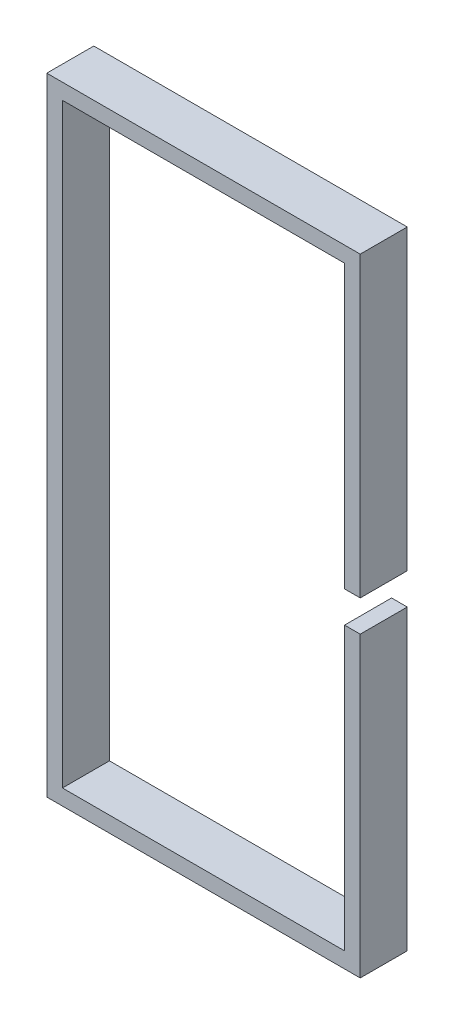
ISO-10303-21;
HEADER;
FILE_DESCRIPTION(('STEP AP214'),'2;1');
FILE_NAME('part.step','',(''),(''),'','','');
FILE_SCHEMA(('AUTOMOTIVE_DESIGN { 1 0 10303 214 1 1 1 1 }'));
ENDSEC;
DATA;
#1=APPLICATION_CONTEXT('core data for automotive mechanical design processes');
#2=APPLICATION_PROTOCOL_DEFINITION('international standard','automotive_design',2000,#1);
#3=PRODUCT_CONTEXT('',#1,'mechanical');
#4=PRODUCT('Part','Part','',(#3));
#5=PRODUCT_RELATED_PRODUCT_CATEGORY('part','',(#4));
#6=PRODUCT_DEFINITION_FORMATION('','',#4);
#7=PRODUCT_DEFINITION_CONTEXT('part definition',#1,'design');
#8=PRODUCT_DEFINITION('design','',#6,#7);
#9=PRODUCT_DEFINITION_SHAPE('','',#8);
#10=(LENGTH_UNIT() NAMED_UNIT(*) SI_UNIT(.MILLI.,.METRE.));
#11=(NAMED_UNIT(*) PLANE_ANGLE_UNIT() SI_UNIT($,.RADIAN.));
#12=(NAMED_UNIT(*) SI_UNIT($,.STERADIAN.) SOLID_ANGLE_UNIT());
#13=UNCERTAINTY_MEASURE_WITH_UNIT(LENGTH_MEASURE(1.E-05),#10,'distance_accuracy_value','');
#14=(GEOMETRIC_REPRESENTATION_CONTEXT(3) GLOBAL_UNCERTAINTY_ASSIGNED_CONTEXT((#13)) GLOBAL_UNIT_ASSIGNED_CONTEXT((#10,
#11,#12)) REPRESENTATION_CONTEXT('',''));
#15=CARTESIAN_POINT('',(0.,0.,0.));
#16=DIRECTION('',(0.,0.,1.));
#17=DIRECTION('',(1.,0.,0.));
#18=AXIS2_PLACEMENT_3D('',#15,#16,#17);
#19=CARTESIAN_POINT('',(-10.,0.,30.));
#20=DIRECTION('',(1.,0.,0.));
#21=DIRECTION('',(0.,0.,-1.));
#22=AXIS2_PLACEMENT_3D('',#19,#20,#21);
#23=PLANE('',#22);
#24=DIRECTION('',(0.,1.,0.));
#25=VECTOR('',#24,1.);
#26=CARTESIAN_POINT('',(-10.,0.,0.));
#27=LINE('',#26,#25);
#28=CARTESIAN_POINT('',(-10.,-10.,0.));
#29=VERTEX_POINT('',#28);
#30=CARTESIAN_POINT('',(-10.,-190.,0.));
#31=VERTEX_POINT('',#30);
#32=EDGE_CURVE('E164',#29,#31,#27,.F.);
#33=ORIENTED_EDGE('',*,*,#32,.T.);
#34=DIRECTION('',(0.,0.,-1.));
#35=VECTOR('',#34,1.);
#36=CARTESIAN_POINT('',(-10.,-190.,30.));
#37=LINE('',#36,#35);
#38=CARTESIAN_POINT('',(-10.,-190.,30.));
#39=VERTEX_POINT('',#38);
#40=EDGE_CURVE('E11',#39,#31,#37,.T.);
#41=ORIENTED_EDGE('',*,*,#40,.F.);
#42=DIRECTION('',(0.,1.,0.));
#43=VECTOR('',#42,1.);
#44=CARTESIAN_POINT('',(-10.,0.,30.));
#45=LINE('',#44,#43);
#46=CARTESIAN_POINT('',(-10.,-10.,30.));
#47=VERTEX_POINT('',#46);
#48=EDGE_CURVE('E108',#47,#39,#45,.F.);
#49=ORIENTED_EDGE('',*,*,#48,.F.);
#50=DIRECTION('',(0.,0.,-1.));
#51=VECTOR('',#50,1.);
#52=CARTESIAN_POINT('',(-10.,-10.,30.));
#53=LINE('',#52,#51);
#54=EDGE_CURVE('E160',#47,#29,#53,.T.);
#55=ORIENTED_EDGE('',*,*,#54,.T.);
#56=EDGE_LOOP('',(#33,#41,#49,#55));
#57=FACE_BOUND('',#56,.T.);
#58=ADVANCED_FACE('F39',(#57),#23,.F.);
#59=CARTESIAN_POINT('',(0.,-190.,30.));
#60=DIRECTION('',(0.,-1.,0.));
#61=DIRECTION('',(0.,0.,-1.));
#62=AXIS2_PLACEMENT_3D('',#59,#60,#61);
#63=PLANE('',#62);
#64=DIRECTION('',(-1.,0.,0.));
#65=VECTOR('',#64,1.);
#66=CARTESIAN_POINT('',(0.,-190.,0.));
#67=LINE('',#66,#65);
#68=CARTESIAN_POINT('',(0.,-190.,0.));
#69=VERTEX_POINT('',#68);
#70=EDGE_CURVE('E168',#69,#31,#67,.T.);
#71=ORIENTED_EDGE('',*,*,#70,.F.);
#72=DIRECTION('',(0.,0.,-1.));
#73=VECTOR('',#72,1.);
#74=CARTESIAN_POINT('',(0.,-190.,30.));
#75=LINE('',#74,#73);
#76=CARTESIAN_POINT('',(0.,-190.,30.));
#77=VERTEX_POINT('',#76);
#78=EDGE_CURVE('E48',#77,#69,#75,.T.);
#79=ORIENTED_EDGE('',*,*,#78,.F.);
#80=DIRECTION('',(-1.,0.,0.));
#81=VECTOR('',#80,1.);
#82=CARTESIAN_POINT('',(0.,-190.,30.));
#83=LINE('',#82,#81);
#84=EDGE_CURVE('E251',#77,#39,#83,.T.);
#85=ORIENTED_EDGE('',*,*,#84,.T.);
#86=ORIENTED_EDGE('',*,*,#40,.T.);
#87=EDGE_LOOP('',(#71,#79,#85,#86));
#88=FACE_BOUND('',#87,.T.);
#89=ADVANCED_FACE('F238',(#88),#63,.T.);
#90=CARTESIAN_POINT('',(0.,0.,30.));
#91=DIRECTION('',(1.,0.,0.));
#92=DIRECTION('',(0.,0.,-1.));
#93=AXIS2_PLACEMENT_3D('',#90,#91,#92);
#94=PLANE('',#93);
#95=DIRECTION('',(0.,-1.,0.));
#96=VECTOR('',#95,1.);
#97=CARTESIAN_POINT('',(0.,0.,0.));
#98=LINE('',#97,#96);
#99=CARTESIAN_POINT('',(0.,0.,0.));
#100=VERTEX_POINT('',#99);
#101=EDGE_CURVE('E172',#100,#69,#98,.T.);
#102=ORIENTED_EDGE('',*,*,#101,.F.);
#103=DIRECTION('',(0.,0.,-1.));
#104=VECTOR('',#103,1.);
#105=CARTESIAN_POINT('',(0.,0.,30.));
#106=LINE('',#105,#104);
#107=CARTESIAN_POINT('',(0.,0.,30.));
#108=VERTEX_POINT('',#107);
#109=EDGE_CURVE('E226',#108,#100,#106,.T.);
#110=ORIENTED_EDGE('',*,*,#109,.F.);
#111=DIRECTION('',(0.,-1.,0.));
#112=VECTOR('',#111,1.);
#113=CARTESIAN_POINT('',(0.,0.,30.));
#114=LINE('',#113,#112);
#115=EDGE_CURVE('E235',#108,#77,#114,.T.);
#116=ORIENTED_EDGE('',*,*,#115,.T.);
#117=ORIENTED_EDGE('',*,*,#78,.T.);
#118=EDGE_LOOP('',(#102,#110,#116,#117));
#119=FACE_BOUND('',#118,.T.);
#120=ADVANCED_FACE('F233',(#119),#94,.T.);
#121=CARTESIAN_POINT('',(0.,0.,30.));
#122=DIRECTION('',(0.,1.,0.));
#123=DIRECTION('',(0.,0.,1.));
#124=AXIS2_PLACEMENT_3D('',#121,#122,#123);
#125=PLANE('',#124);
#126=DIRECTION('',(1.,0.,0.));
#127=VECTOR('',#126,1.);
#128=CARTESIAN_POINT('',(0.,0.,0.));
#129=LINE('',#128,#127);
#130=CARTESIAN_POINT('',(-200.,0.,0.));
#131=VERTEX_POINT('',#130);
#132=EDGE_CURVE('E176',#131,#100,#129,.T.);
#133=ORIENTED_EDGE('',*,*,#132,.F.);
#134=DIRECTION('',(0.,0.,-1.));
#135=VECTOR('',#134,1.);
#136=CARTESIAN_POINT('',(-200.,0.,30.));
#137=LINE('',#136,#135);
#138=CARTESIAN_POINT('',(-200.,0.,30.));
#139=VERTEX_POINT('',#138);
#140=EDGE_CURVE('E223',#139,#131,#137,.T.);
#141=ORIENTED_EDGE('',*,*,#140,.F.);
#142=DIRECTION('',(1.,0.,0.));
#143=VECTOR('',#142,1.);
#144=CARTESIAN_POINT('',(0.,0.,30.));
#145=LINE('',#144,#143);
#146=EDGE_CURVE('E248',#139,#108,#145,.T.);
#147=ORIENTED_EDGE('',*,*,#146,.T.);
#148=ORIENTED_EDGE('',*,*,#109,.T.);
#149=EDGE_LOOP('',(#133,#141,#147,#148));
#150=FACE_BOUND('',#149,.T.);
#151=ADVANCED_FACE('F245',(#150),#125,.T.);
#152=CARTESIAN_POINT('',(-200.,0.,30.));
#153=DIRECTION('',(-1.,0.,0.));
#154=DIRECTION('',(0.,0.,1.));
#155=AXIS2_PLACEMENT_3D('',#152,#153,#154);
#156=PLANE('',#155);
#157=DIRECTION('',(0.,1.,0.));
#158=VECTOR('',#157,1.);
#159=CARTESIAN_POINT('',(-200.,0.,0.));
#160=LINE('',#159,#158);
#161=CARTESIAN_POINT('',(-200.,-400.,0.));
#162=VERTEX_POINT('',#161);
#163=EDGE_CURVE('E180',#162,#131,#160,.T.);
#164=ORIENTED_EDGE('',*,*,#163,.F.);
#165=DIRECTION('',(0.,0.,-1.));
#166=VECTOR('',#165,1.);
#167=CARTESIAN_POINT('',(-200.,-400.,30.));
#168=LINE('',#167,#166);
#169=CARTESIAN_POINT('',(-200.,-400.,30.));
#170=VERTEX_POINT('',#169);
#171=EDGE_CURVE('E220',#170,#162,#168,.T.);
#172=ORIENTED_EDGE('',*,*,#171,.F.);
#173=DIRECTION('',(0.,1.,0.));
#174=VECTOR('',#173,1.);
#175=CARTESIAN_POINT('',(-200.,0.,30.));
#176=LINE('',#175,#174);
#177=EDGE_CURVE('E256',#170,#139,#176,.T.);
#178=ORIENTED_EDGE('',*,*,#177,.T.);
#179=ORIENTED_EDGE('',*,*,#140,.T.);
#180=EDGE_LOOP('',(#164,#172,#178,#179));
#181=FACE_BOUND('',#180,.T.);
#182=ADVANCED_FACE('F361',(#181),#156,.T.);
#183=CARTESIAN_POINT('',(-200.,-400.,30.));
#184=DIRECTION('',(0.,-1.,0.));
#185=DIRECTION('',(0.,0.,-1.));
#186=AXIS2_PLACEMENT_3D('',#183,#184,#185);
#187=PLANE('',#186);
#188=DIRECTION('',(-1.,0.,0.));
#189=VECTOR('',#188,1.);
#190=CARTESIAN_POINT('',(-200.,-400.,0.));
#191=LINE('',#190,#189);
#192=CARTESIAN_POINT('',(0.,-400.,0.));
#193=VERTEX_POINT('',#192);
#194=EDGE_CURVE('E184',#193,#162,#191,.T.);
#195=ORIENTED_EDGE('',*,*,#194,.F.);
#196=DIRECTION('',(0.,0.,-1.));
#197=VECTOR('',#196,1.);
#198=CARTESIAN_POINT('',(0.,-400.,30.));
#199=LINE('',#198,#197);
#200=CARTESIAN_POINT('',(0.,-400.,30.));
#201=VERTEX_POINT('',#200);
#202=EDGE_CURVE('E217',#201,#193,#199,.T.);
#203=ORIENTED_EDGE('',*,*,#202,.F.);
#204=DIRECTION('',(-1.,0.,0.));
#205=VECTOR('',#204,1.);
#206=CARTESIAN_POINT('',(-200.,-400.,30.));
#207=LINE('',#206,#205);
#208=EDGE_CURVE('E263',#201,#170,#207,.T.);
#209=ORIENTED_EDGE('',*,*,#208,.T.);
#210=ORIENTED_EDGE('',*,*,#171,.T.);
#211=EDGE_LOOP('',(#195,#203,#209,#210));
#212=FACE_BOUND('',#211,.T.);
#213=ADVANCED_FACE('F352',(#212),#187,.T.);
#214=CARTESIAN_POINT('',(0.,-400.,30.));
#215=DIRECTION('',(1.,0.,0.));
#216=DIRECTION('',(0.,0.,-1.));
#217=AXIS2_PLACEMENT_3D('',#214,#215,#216);
#218=PLANE('',#217);
#219=DIRECTION('',(0.,-1.,0.));
#220=VECTOR('',#219,1.);
#221=CARTESIAN_POINT('',(0.,-400.,0.));
#222=LINE('',#221,#220);
#223=CARTESIAN_POINT('',(0.,-210.,0.));
#224=VERTEX_POINT('',#223);
#225=EDGE_CURVE('E188',#224,#193,#222,.T.);
#226=ORIENTED_EDGE('',*,*,#225,.F.);
#227=DIRECTION('',(0.,0.,-1.));
#228=VECTOR('',#227,1.);
#229=CARTESIAN_POINT('',(0.,-210.,30.));
#230=LINE('',#229,#228);
#231=CARTESIAN_POINT('',(0.,-210.,30.));
#232=VERTEX_POINT('',#231);
#233=EDGE_CURVE('E214',#232,#224,#230,.T.);
#234=ORIENTED_EDGE('',*,*,#233,.F.);
#235=DIRECTION('',(0.,-1.,0.));
#236=VECTOR('',#235,1.);
#237=CARTESIAN_POINT('',(0.,-400.,30.));
#238=LINE('',#237,#236);
#239=EDGE_CURVE('E267',#232,#201,#238,.T.);
#240=ORIENTED_EDGE('',*,*,#239,.T.);
#241=ORIENTED_EDGE('',*,*,#202,.T.);
#242=EDGE_LOOP('',(#226,#234,#240,#241));
#243=FACE_BOUND('',#242,.T.);
#244=ADVANCED_FACE('F282',(#243),#218,.T.);
#245=CARTESIAN_POINT('',(-10.,-210.,30.));
#246=DIRECTION('',(0.,1.,0.));
#247=DIRECTION('',(0.,0.,1.));
#248=AXIS2_PLACEMENT_3D('',#245,#246,#247);
#249=PLANE('',#248);
#250=DIRECTION('',(1.,0.,0.));
#251=VECTOR('',#250,1.);
#252=CARTESIAN_POINT('',(-10.,-210.,0.));
#253=LINE('',#252,#251);
#254=CARTESIAN_POINT('',(-10.,-210.,0.));
#255=VERTEX_POINT('',#254);
#256=EDGE_CURVE('E192',#255,#224,#253,.T.);
#257=ORIENTED_EDGE('',*,*,#256,.F.);
#258=DIRECTION('',(0.,0.,-1.));
#259=VECTOR('',#258,1.);
#260=CARTESIAN_POINT('',(-10.,-210.,30.));
#261=LINE('',#260,#259);
#262=CARTESIAN_POINT('',(-10.,-210.,30.));
#263=VERTEX_POINT('',#262);
#264=EDGE_CURVE('E211',#263,#255,#261,.T.);
#265=ORIENTED_EDGE('',*,*,#264,.F.);
#266=DIRECTION('',(1.,0.,0.));
#267=VECTOR('',#266,1.);
#268=CARTESIAN_POINT('',(-10.,-210.,30.));
#269=LINE('',#268,#267);
#270=EDGE_CURVE('E271',#263,#232,#269,.T.);
#271=ORIENTED_EDGE('',*,*,#270,.T.);
#272=ORIENTED_EDGE('',*,*,#233,.T.);
#273=EDGE_LOOP('',(#257,#265,#271,#272));
#274=FACE_BOUND('',#273,.T.);
#275=ADVANCED_FACE('F277',(#274),#249,.T.);
#276=CARTESIAN_POINT('',(-10.,-400.,30.));
#277=DIRECTION('',(1.,0.,0.));
#278=DIRECTION('',(0.,0.,-1.));
#279=AXIS2_PLACEMENT_3D('',#276,#277,#278);
#280=PLANE('',#279);
#281=DIRECTION('',(0.,1.,0.));
#282=VECTOR('',#281,1.);
#283=CARTESIAN_POINT('',(-10.,-400.,0.));
#284=LINE('',#283,#282);
#285=CARTESIAN_POINT('',(-10.,-390.,0.));
#286=VERTEX_POINT('',#285);
#287=EDGE_CURVE('E196',#255,#286,#284,.F.);
#288=ORIENTED_EDGE('',*,*,#287,.T.);
#289=DIRECTION('',(0.,0.,-1.));
#290=VECTOR('',#289,1.);
#291=CARTESIAN_POINT('',(-10.,-390.,30.));
#292=LINE('',#291,#290);
#293=CARTESIAN_POINT('',(-10.,-390.,30.));
#294=VERTEX_POINT('',#293);
#295=EDGE_CURVE('E153',#294,#286,#292,.T.);
#296=ORIENTED_EDGE('',*,*,#295,.F.);
#297=DIRECTION('',(0.,1.,0.));
#298=VECTOR('',#297,1.);
#299=CARTESIAN_POINT('',(-10.,-400.,30.));
#300=LINE('',#299,#298);
#301=EDGE_CURVE('E142',#263,#294,#300,.F.);
#302=ORIENTED_EDGE('',*,*,#301,.F.);
#303=ORIENTED_EDGE('',*,*,#264,.T.);
#304=EDGE_LOOP('',(#288,#296,#302,#303));
#305=FACE_BOUND('',#304,.T.);
#306=ADVANCED_FACE('F286',(#305),#280,.F.);
#307=CARTESIAN_POINT('',(-200.,-390.,30.));
#308=DIRECTION('',(0.,-1.,0.));
#309=DIRECTION('',(0.,0.,-1.));
#310=AXIS2_PLACEMENT_3D('',#307,#308,#309);
#311=PLANE('',#310);
#312=DIRECTION('',(1.,0.,0.));
#313=VECTOR('',#312,1.);
#314=CARTESIAN_POINT('',(-200.,-390.,0.));
#315=LINE('',#314,#313);
#316=CARTESIAN_POINT('',(-190.,-390.,0.));
#317=VERTEX_POINT('',#316);
#318=EDGE_CURVE('E151',#286,#317,#315,.F.);
#319=ORIENTED_EDGE('',*,*,#318,.T.);
#320=DIRECTION('',(0.,0.,-1.));
#321=VECTOR('',#320,1.);
#322=CARTESIAN_POINT('',(-190.,-390.,30.));
#323=LINE('',#322,#321);
#324=CARTESIAN_POINT('',(-190.,-390.,30.));
#325=VERTEX_POINT('',#324);
#326=EDGE_CURVE('E148',#325,#317,#323,.T.);
#327=ORIENTED_EDGE('',*,*,#326,.F.);
#328=DIRECTION('',(1.,0.,0.));
#329=VECTOR('',#328,1.);
#330=CARTESIAN_POINT('',(-200.,-390.,30.));
#331=LINE('',#330,#329);
#332=EDGE_CURVE('E135',#294,#325,#331,.F.);
#333=ORIENTED_EDGE('',*,*,#332,.F.);
#334=ORIENTED_EDGE('',*,*,#295,.T.);
#335=EDGE_LOOP('',(#319,#327,#333,#334));
#336=FACE_BOUND('',#335,.T.);
#337=ADVANCED_FACE('F149',(#336),#311,.F.);
#338=CARTESIAN_POINT('',(-190.,0.,30.));
#339=DIRECTION('',(-1.,0.,0.));
#340=DIRECTION('',(0.,0.,1.));
#341=AXIS2_PLACEMENT_3D('',#338,#339,#340);
#342=PLANE('',#341);
#343=DIRECTION('',(0.,1.,0.));
#344=VECTOR('',#343,1.);
#345=CARTESIAN_POINT('',(-190.,0.,0.));
#346=LINE('',#345,#344);
#347=CARTESIAN_POINT('',(-190.,-10.,0.));
#348=VERTEX_POINT('',#347);
#349=EDGE_CURVE('E96',#317,#348,#346,.T.);
#350=ORIENTED_EDGE('',*,*,#349,.T.);
#351=DIRECTION('',(0.,0.,-1.));
#352=VECTOR('',#351,1.);
#353=CARTESIAN_POINT('',(-190.,-10.,30.));
#354=LINE('',#353,#352);
#355=CARTESIAN_POINT('',(-190.,-10.,30.));
#356=VERTEX_POINT('',#355);
#357=EDGE_CURVE('E154',#356,#348,#354,.T.);
#358=ORIENTED_EDGE('',*,*,#357,.F.);
#359=DIRECTION('',(0.,1.,0.));
#360=VECTOR('',#359,1.);
#361=CARTESIAN_POINT('',(-190.,0.,30.));
#362=LINE('',#361,#360);
#363=EDGE_CURVE('E139',#325,#356,#362,.T.);
#364=ORIENTED_EDGE('',*,*,#363,.F.);
#365=ORIENTED_EDGE('',*,*,#326,.T.);
#366=EDGE_LOOP('',(#350,#358,#364,#365));
#367=FACE_BOUND('',#366,.T.);
#368=ADVANCED_FACE('F156',(#367),#342,.F.);
#369=CARTESIAN_POINT('',(0.,-10.,30.));
#370=DIRECTION('',(0.,1.,0.));
#371=DIRECTION('',(0.,0.,1.));
#372=AXIS2_PLACEMENT_3D('',#369,#370,#371);
#373=PLANE('',#372);
#374=DIRECTION('',(1.,0.,0.));
#375=VECTOR('',#374,1.);
#376=CARTESIAN_POINT('',(0.,-10.,0.));
#377=LINE('',#376,#375);
#378=EDGE_CURVE('E102',#348,#29,#377,.T.);
#379=ORIENTED_EDGE('',*,*,#378,.T.);
#380=ORIENTED_EDGE('',*,*,#54,.F.);
#381=DIRECTION('',(1.,0.,0.));
#382=VECTOR('',#381,1.);
#383=CARTESIAN_POINT('',(0.,-10.,30.));
#384=LINE('',#383,#382);
#385=EDGE_CURVE('E56',#356,#47,#384,.T.);
#386=ORIENTED_EDGE('',*,*,#385,.F.);
#387=ORIENTED_EDGE('',*,*,#357,.T.);
#388=EDGE_LOOP('',(#379,#380,#386,#387));
#389=FACE_BOUND('',#388,.T.);
#390=ADVANCED_FACE('F300',(#389),#373,.F.);
#391=CARTESIAN_POINT('',(0.,0.,30.));
#392=DIRECTION('',(0.,0.,1.));
#393=DIRECTION('',(1.,0.,0.));
#394=AXIS2_PLACEMENT_3D('',#391,#392,#393);
#395=PLANE('',#394);
#396=ORIENTED_EDGE('',*,*,#48,.T.);
#397=ORIENTED_EDGE('',*,*,#84,.F.);
#398=ORIENTED_EDGE('',*,*,#115,.F.);
#399=ORIENTED_EDGE('',*,*,#146,.F.);
#400=ORIENTED_EDGE('',*,*,#177,.F.);
#401=ORIENTED_EDGE('',*,*,#208,.F.);
#402=ORIENTED_EDGE('',*,*,#239,.F.);
#403=ORIENTED_EDGE('',*,*,#270,.F.);
#404=ORIENTED_EDGE('',*,*,#301,.T.);
#405=ORIENTED_EDGE('',*,*,#332,.T.);
#406=ORIENTED_EDGE('',*,*,#363,.T.);
#407=ORIENTED_EDGE('',*,*,#385,.T.);
#408=EDGE_LOOP('',(#396,#397,#398,#399,#400,#401,#402,#403,#404,#405,#406,#407));
#409=FACE_BOUND('',#408,.T.);
#410=ADVANCED_FACE('F137',(#409),#395,.T.);
#411=CARTESIAN_POINT('',(0.,0.,0.));
#412=DIRECTION('',(0.,0.,1.));
#413=DIRECTION('',(1.,0.,0.));
#414=AXIS2_PLACEMENT_3D('',#411,#412,#413);
#415=PLANE('',#414);
#416=ORIENTED_EDGE('',*,*,#32,.F.);
#417=ORIENTED_EDGE('',*,*,#378,.F.);
#418=ORIENTED_EDGE('',*,*,#349,.F.);
#419=ORIENTED_EDGE('',*,*,#318,.F.);
#420=ORIENTED_EDGE('',*,*,#287,.F.);
#421=ORIENTED_EDGE('',*,*,#256,.T.);
#422=ORIENTED_EDGE('',*,*,#225,.T.);
#423=ORIENTED_EDGE('',*,*,#194,.T.);
#424=ORIENTED_EDGE('',*,*,#163,.T.);
#425=ORIENTED_EDGE('',*,*,#132,.T.);
#426=ORIENTED_EDGE('',*,*,#101,.T.);
#427=ORIENTED_EDGE('',*,*,#70,.T.);
#428=EDGE_LOOP('',(#416,#417,#418,#419,#420,#421,#422,#423,#424,#425,#426,#427));
#429=FACE_BOUND('',#428,.T.);
#430=ADVANCED_FACE('F241',(#429),#415,.F.);
#431=CLOSED_SHELL('',(#58,#89,#120,#151,#182,#213,#244,#275,#306,#337,#368,#390,#410,#430));
#432=MANIFOLD_SOLID_BREP('B2',#431);
#433=ADVANCED_BREP_SHAPE_REPRESENTATION('',(#18,#432),#14);
#434=SHAPE_DEFINITION_REPRESENTATION(#9,#433);
ENDSEC;
END-ISO-10303-21;
